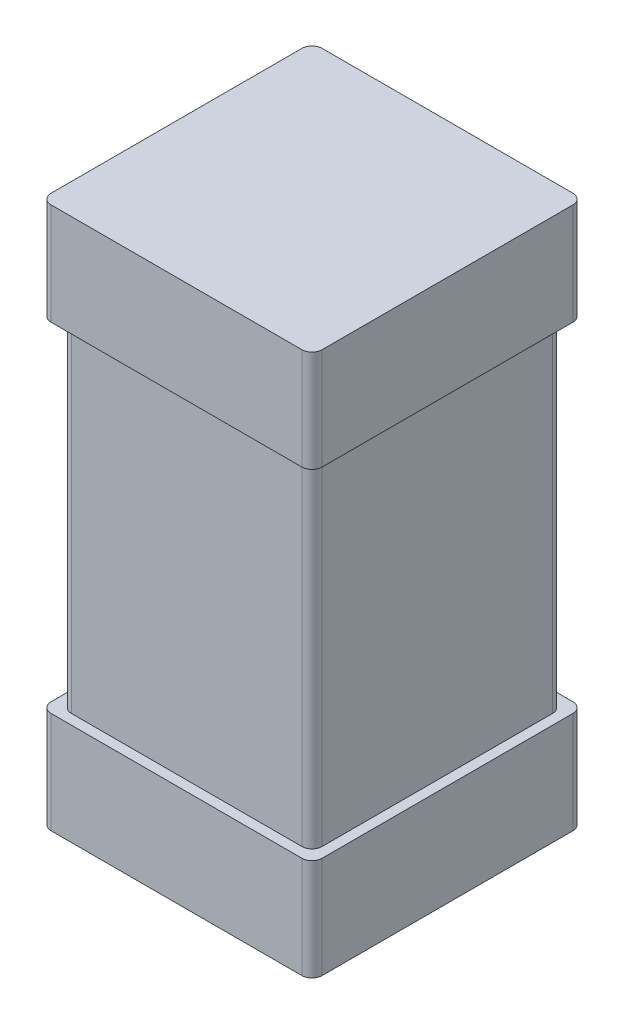
ISO-10303-21;
HEADER;
FILE_DESCRIPTION(('STEP AP214'),'2;1');
FILE_NAME('part.step','',(''),(''),'','','');
FILE_SCHEMA(('AUTOMOTIVE_DESIGN { 1 0 10303 214 1 1 1 1 }'));
ENDSEC;
DATA;
#1=APPLICATION_CONTEXT('core data for automotive mechanical design processes');
#2=APPLICATION_PROTOCOL_DEFINITION('international standard','automotive_design',2000,#1);
#3=PRODUCT_CONTEXT('',#1,'mechanical');
#4=PRODUCT('Part','Part','',(#3));
#5=PRODUCT_RELATED_PRODUCT_CATEGORY('part','',(#4));
#6=PRODUCT_DEFINITION_FORMATION('','',#4);
#7=PRODUCT_DEFINITION_CONTEXT('part definition',#1,'design');
#8=PRODUCT_DEFINITION('design','',#6,#7);
#9=PRODUCT_DEFINITION_SHAPE('','',#8);
#10=(LENGTH_UNIT() NAMED_UNIT(*) SI_UNIT(.MILLI.,.METRE.));
#11=(NAMED_UNIT(*) PLANE_ANGLE_UNIT() SI_UNIT($,.RADIAN.));
#12=(NAMED_UNIT(*) SI_UNIT($,.STERADIAN.) SOLID_ANGLE_UNIT());
#13=UNCERTAINTY_MEASURE_WITH_UNIT(LENGTH_MEASURE(1.E-05),#10,'distance_accuracy_value','');
#14=(GEOMETRIC_REPRESENTATION_CONTEXT(3) GLOBAL_UNCERTAINTY_ASSIGNED_CONTEXT((#13)) GLOBAL_UNIT_ASSIGNED_CONTEXT((#10,
#11,#12)) REPRESENTATION_CONTEXT('',''));
#15=CARTESIAN_POINT('',(0.,0.,0.));
#16=DIRECTION('',(0.,0.,1.));
#17=DIRECTION('',(1.,0.,0.));
#18=AXIS2_PLACEMENT_3D('',#15,#16,#17);
#19=CARTESIAN_POINT('',(150.492744279938,114.37054329235,112.211582908599));
#20=DIRECTION('',(0.,1.,0.));
#21=DIRECTION('',(1.,0.,0.));
#22=AXIS2_PLACEMENT_3D('',#19,#20,#21);
#23=PLANE('',#22);
#24=DIRECTION('',(0.,0.,1.));
#25=VECTOR('',#24,1.);
#26=CARTESIAN_POINT('',(150.492744279938,114.37054329235,112.211582908599));
#27=LINE('',#26,#25);
#28=CARTESIAN_POINT('',(150.492744279938,114.37054329235,112.241582908599));
#29=VERTEX_POINT('',#28);
#30=CARTESIAN_POINT('',(150.492744279938,114.37054329235,112.981582908599));
#31=VERTEX_POINT('',#30);
#32=EDGE_CURVE('E67',#29,#31,#27,.T.);
#33=ORIENTED_EDGE('',*,*,#32,.F.);
#34=CARTESIAN_POINT('',(150.462744279938,114.37054329235,112.241582908599));
#35=DIRECTION('',(0.,1.,0.));
#36=DIRECTION('',(0.,0.,1.));
#37=AXIS2_PLACEMENT_3D('',#34,#35,#36);
#38=CIRCLE('',#37,0.0300000000000023);
#39=CARTESIAN_POINT('',(150.462744279938,114.37054329235,112.211582908599));
#40=VERTEX_POINT('',#39);
#41=EDGE_CURVE('E11',#29,#40,#38,.T.);
#42=ORIENTED_EDGE('',*,*,#41,.T.);
#43=DIRECTION('',(-1.,0.,0.));
#44=VECTOR('',#43,1.);
#45=CARTESIAN_POINT('',(150.492744279938,114.37054329235,112.211582908599));
#46=LINE('',#45,#44);
#47=CARTESIAN_POINT('',(149.722744279938,114.37054329235,112.211582908599));
#48=VERTEX_POINT('',#47);
#49=EDGE_CURVE('E55',#40,#48,#46,.T.);
#50=ORIENTED_EDGE('',*,*,#49,.T.);
#51=CARTESIAN_POINT('',(149.722744279938,114.37054329235,112.241582908599));
#52=DIRECTION('',(0.,-1.,0.));
#53=DIRECTION('',(0.,0.,1.));
#54=AXIS2_PLACEMENT_3D('',#51,#52,#53);
#55=CIRCLE('',#54,0.0300000000000023);
#56=CARTESIAN_POINT('',(149.692744279938,114.37054329235,112.241582908599));
#57=VERTEX_POINT('',#56);
#58=EDGE_CURVE('E442',#57,#48,#55,.T.);
#59=ORIENTED_EDGE('',*,*,#58,.F.);
#60=DIRECTION('',(0.,0.,1.));
#61=VECTOR('',#60,1.);
#62=CARTESIAN_POINT('',(149.692744279938,114.37054329235,112.211582908599));
#63=LINE('',#62,#61);
#64=CARTESIAN_POINT('',(149.692744279938,114.37054329235,112.981582908599));
#65=VERTEX_POINT('',#64);
#66=EDGE_CURVE('E313',#57,#65,#63,.T.);
#67=ORIENTED_EDGE('',*,*,#66,.T.);
#68=CARTESIAN_POINT('',(149.722744279938,114.37054329235,112.981582908599));
#69=DIRECTION('',(0.,1.,0.));
#70=DIRECTION('',(0.,0.,1.));
#71=AXIS2_PLACEMENT_3D('',#68,#69,#70);
#72=CIRCLE('',#71,0.0300000000000023);
#73=CARTESIAN_POINT('',(149.722744279938,114.37054329235,113.011582908599));
#74=VERTEX_POINT('',#73);
#75=EDGE_CURVE('E309',#65,#74,#72,.T.);
#76=ORIENTED_EDGE('',*,*,#75,.T.);
#77=DIRECTION('',(-1.,0.,0.));
#78=VECTOR('',#77,1.);
#79=CARTESIAN_POINT('',(150.492744279938,114.37054329235,113.011582908599));
#80=LINE('',#79,#78);
#81=CARTESIAN_POINT('',(150.462744279938,114.37054329235,113.011582908599));
#82=VERTEX_POINT('',#81);
#83=EDGE_CURVE('E424',#82,#74,#80,.T.);
#84=ORIENTED_EDGE('',*,*,#83,.F.);
#85=CARTESIAN_POINT('',(150.462744279938,114.37054329235,112.981582908599));
#86=DIRECTION('',(0.,-1.,0.));
#87=DIRECTION('',(0.,0.,1.));
#88=AXIS2_PLACEMENT_3D('',#85,#86,#87);
#89=CIRCLE('',#88,0.0300000000000023);
#90=EDGE_CURVE('E323',#31,#82,#89,.T.);
#91=ORIENTED_EDGE('',*,*,#90,.F.);
#92=EDGE_LOOP('',(#33,#42,#50,#59,#67,#76,#84,#91));
#93=FACE_BOUND('',#92,.T.);
#94=ADVANCED_FACE('F44',(#93),#23,.T.);
#95=CARTESIAN_POINT('',(149.692744279938,114.07054329235,112.211582908599));
#96=DIRECTION('',(-1.,0.,0.));
#97=DIRECTION('',(0.,0.,1.));
#98=AXIS2_PLACEMENT_3D('',#95,#96,#97);
#99=PLANE('',#98);
#100=ORIENTED_EDGE('',*,*,#66,.F.);
#101=DIRECTION('',(0.,1.,0.));
#102=VECTOR('',#101,1.);
#103=CARTESIAN_POINT('',(149.692744279938,114.07054329235,112.241582908599));
#104=LINE('',#103,#102);
#105=CARTESIAN_POINT('',(149.692744279938,114.07054329235,112.241582908599));
#106=VERTEX_POINT('',#105);
#107=EDGE_CURVE('E225',#106,#57,#104,.T.);
#108=ORIENTED_EDGE('',*,*,#107,.F.);
#109=DIRECTION('',(0.,0.,1.));
#110=VECTOR('',#109,1.);
#111=CARTESIAN_POINT('',(149.692744279938,114.07054329235,112.211582908599));
#112=LINE('',#111,#110);
#113=CARTESIAN_POINT('',(149.692744279938,114.07054329235,112.981582908599));
#114=VERTEX_POINT('',#113);
#115=EDGE_CURVE('E307',#106,#114,#112,.T.);
#116=ORIENTED_EDGE('',*,*,#115,.T.);
#117=DIRECTION('',(0.,1.,0.));
#118=VECTOR('',#117,1.);
#119=CARTESIAN_POINT('',(149.692744279938,114.07054329235,112.981582908599));
#120=LINE('',#119,#118);
#121=EDGE_CURVE('E304',#114,#65,#120,.T.);
#122=ORIENTED_EDGE('',*,*,#121,.T.);
#123=EDGE_LOOP('',(#100,#108,#116,#122));
#124=FACE_BOUND('',#123,.T.);
#125=ADVANCED_FACE('F599',(#124),#99,.T.);
#126=CARTESIAN_POINT('',(149.722744279938,114.07054329235,112.981582908599));
#127=DIRECTION('',(0.,1.,0.));
#128=DIRECTION('',(-1.,0.,0.));
#129=AXIS2_PLACEMENT_3D('',#126,#127,#128);
#130=CYLINDRICAL_SURFACE('',#129,0.0300000000000023);
#131=CARTESIAN_POINT('',(149.722744279938,114.07054329235,112.981582908599));
#132=DIRECTION('',(0.,1.,0.));
#133=DIRECTION('',(0.,0.,1.));
#134=AXIS2_PLACEMENT_3D('',#131,#132,#133);
#135=CIRCLE('',#134,0.0300000000000023);
#136=CARTESIAN_POINT('',(149.722744279938,114.07054329235,113.011582908599));
#137=VERTEX_POINT('',#136);
#138=EDGE_CURVE('E308',#114,#137,#135,.T.);
#139=ORIENTED_EDGE('',*,*,#138,.T.);
#140=DIRECTION('',(0.,1.,0.));
#141=VECTOR('',#140,1.);
#142=CARTESIAN_POINT('',(149.722744279938,114.07054329235,113.011582908599));
#143=LINE('',#142,#141);
#144=EDGE_CURVE('E488',#137,#74,#143,.T.);
#145=ORIENTED_EDGE('',*,*,#144,.T.);
#146=ORIENTED_EDGE('',*,*,#75,.F.);
#147=ORIENTED_EDGE('',*,*,#121,.F.);
#148=EDGE_LOOP('',(#139,#145,#146,#147));
#149=FACE_BOUND('',#148,.T.);
#150=ADVANCED_FACE('F604',(#149),#130,.T.);
#151=CARTESIAN_POINT('',(149.722744279938,114.07054329235,112.241582908599));
#152=DIRECTION('',(0.,1.,0.));
#153=DIRECTION('',(-1.,0.,0.));
#154=AXIS2_PLACEMENT_3D('',#151,#152,#153);
#155=CYLINDRICAL_SURFACE('',#154,0.0300000000000023);
#156=ORIENTED_EDGE('',*,*,#107,.T.);
#157=ORIENTED_EDGE('',*,*,#58,.T.);
#158=DIRECTION('',(0.,1.,0.));
#159=VECTOR('',#158,1.);
#160=CARTESIAN_POINT('',(149.722744279938,114.07054329235,112.211582908599));
#161=LINE('',#160,#159);
#162=CARTESIAN_POINT('',(149.722744279938,114.07054329235,112.211582908599));
#163=VERTEX_POINT('',#162);
#164=EDGE_CURVE('E428',#163,#48,#161,.T.);
#165=ORIENTED_EDGE('',*,*,#164,.F.);
#166=CARTESIAN_POINT('',(149.722744279938,114.07054329235,112.241582908599));
#167=DIRECTION('',(0.,-1.,0.));
#168=DIRECTION('',(0.,0.,1.));
#169=AXIS2_PLACEMENT_3D('',#166,#167,#168);
#170=CIRCLE('',#169,0.0300000000000023);
#171=EDGE_CURVE('E355',#106,#163,#170,.T.);
#172=ORIENTED_EDGE('',*,*,#171,.F.);
#173=EDGE_LOOP('',(#156,#157,#165,#172));
#174=FACE_BOUND('',#173,.T.);
#175=ADVANCED_FACE('F671',(#174),#155,.T.);
#176=CARTESIAN_POINT('',(150.492744279938,114.07054329235,113.011582908599));
#177=DIRECTION('',(0.,0.,1.));
#178=DIRECTION('',(1.,0.,0.));
#179=AXIS2_PLACEMENT_3D('',#176,#177,#178);
#180=PLANE('',#179);
#181=DIRECTION('',(-1.,0.,0.));
#182=VECTOR('',#181,1.);
#183=CARTESIAN_POINT('',(150.492744279938,114.07054329235,113.011582908599));
#184=LINE('',#183,#182);
#185=CARTESIAN_POINT('',(150.462744279938,114.07054329235,113.011582908599));
#186=VERTEX_POINT('',#185);
#187=EDGE_CURVE('E358',#186,#137,#184,.T.);
#188=ORIENTED_EDGE('',*,*,#187,.F.);
#189=DIRECTION('',(0.,1.,0.));
#190=VECTOR('',#189,1.);
#191=CARTESIAN_POINT('',(150.462744279938,114.07054329235,113.011582908599));
#192=LINE('',#191,#190);
#193=EDGE_CURVE('E427',#186,#82,#192,.T.);
#194=ORIENTED_EDGE('',*,*,#193,.T.);
#195=ORIENTED_EDGE('',*,*,#83,.T.);
#196=ORIENTED_EDGE('',*,*,#144,.F.);
#197=EDGE_LOOP('',(#188,#194,#195,#196));
#198=FACE_BOUND('',#197,.T.);
#199=ADVANCED_FACE('F621',(#198),#180,.T.);
#200=CARTESIAN_POINT('',(150.492744279938,114.07054329235,112.211582908599));
#201=DIRECTION('',(0.,0.,1.));
#202=DIRECTION('',(1.,0.,0.));
#203=AXIS2_PLACEMENT_3D('',#200,#201,#202);
#204=PLANE('',#203);
#205=ORIENTED_EDGE('',*,*,#164,.T.);
#206=ORIENTED_EDGE('',*,*,#49,.F.);
#207=DIRECTION('',(0.,1.,0.));
#208=VECTOR('',#207,1.);
#209=CARTESIAN_POINT('',(150.462744279938,114.07054329235,112.211582908599));
#210=LINE('',#209,#208);
#211=CARTESIAN_POINT('',(150.462744279938,114.07054329235,112.211582908599));
#212=VERTEX_POINT('',#211);
#213=EDGE_CURVE('E365',#212,#40,#210,.T.);
#214=ORIENTED_EDGE('',*,*,#213,.F.);
#215=DIRECTION('',(-1.,0.,0.));
#216=VECTOR('',#215,1.);
#217=CARTESIAN_POINT('',(150.492744279938,114.07054329235,112.211582908599));
#218=LINE('',#217,#216);
#219=EDGE_CURVE('E432',#212,#163,#218,.T.);
#220=ORIENTED_EDGE('',*,*,#219,.T.);
#221=EDGE_LOOP('',(#205,#206,#214,#220));
#222=FACE_BOUND('',#221,.T.);
#223=ADVANCED_FACE('F617',(#222),#204,.F.);
#224=CARTESIAN_POINT('',(150.462744279938,114.07054329235,112.981582908599));
#225=DIRECTION('',(0.,1.,0.));
#226=DIRECTION('',(1.,0.,0.));
#227=AXIS2_PLACEMENT_3D('',#224,#225,#226);
#228=CYLINDRICAL_SURFACE('',#227,0.0300000000000023);
#229=DIRECTION('',(0.,1.,0.));
#230=VECTOR('',#229,1.);
#231=CARTESIAN_POINT('',(150.492744279938,114.07054329235,112.981582908599));
#232=LINE('',#231,#230);
#233=CARTESIAN_POINT('',(150.492744279938,114.07054329235,112.981582908599));
#234=VERTEX_POINT('',#233);
#235=EDGE_CURVE('E326',#234,#31,#232,.T.);
#236=ORIENTED_EDGE('',*,*,#235,.T.);
#237=ORIENTED_EDGE('',*,*,#90,.T.);
#238=ORIENTED_EDGE('',*,*,#193,.F.);
#239=CARTESIAN_POINT('',(150.462744279938,114.07054329235,112.981582908599));
#240=DIRECTION('',(0.,-1.,0.));
#241=DIRECTION('',(0.,0.,1.));
#242=AXIS2_PLACEMENT_3D('',#239,#240,#241);
#243=CIRCLE('',#242,0.0300000000000023);
#244=EDGE_CURVE('E382',#234,#186,#243,.T.);
#245=ORIENTED_EDGE('',*,*,#244,.F.);
#246=EDGE_LOOP('',(#236,#237,#238,#245));
#247=FACE_BOUND('',#246,.T.);
#248=ADVANCED_FACE('F620',(#247),#228,.T.);
#249=CARTESIAN_POINT('',(150.462744279938,114.07054329235,112.241582908599));
#250=DIRECTION('',(0.,1.,0.));
#251=DIRECTION('',(1.,0.,0.));
#252=AXIS2_PLACEMENT_3D('',#249,#250,#251);
#253=CYLINDRICAL_SURFACE('',#252,0.0300000000000023);
#254=CARTESIAN_POINT('',(150.462744279938,114.07054329235,112.241582908599));
#255=DIRECTION('',(0.,1.,0.));
#256=DIRECTION('',(0.,0.,1.));
#257=AXIS2_PLACEMENT_3D('',#254,#255,#256);
#258=CIRCLE('',#257,0.0300000000000023);
#259=CARTESIAN_POINT('',(150.492744279938,114.07054329235,112.241582908599));
#260=VERTEX_POINT('',#259);
#261=EDGE_CURVE('E327',#260,#212,#258,.T.);
#262=ORIENTED_EDGE('',*,*,#261,.T.);
#263=ORIENTED_EDGE('',*,*,#213,.T.);
#264=ORIENTED_EDGE('',*,*,#41,.F.);
#265=DIRECTION('',(0.,1.,0.));
#266=VECTOR('',#265,1.);
#267=CARTESIAN_POINT('',(150.492744279938,114.07054329235,112.241582908599));
#268=LINE('',#267,#266);
#269=EDGE_CURVE('E368',#260,#29,#268,.T.);
#270=ORIENTED_EDGE('',*,*,#269,.F.);
#271=EDGE_LOOP('',(#262,#263,#264,#270));
#272=FACE_BOUND('',#271,.T.);
#273=ADVANCED_FACE('F595',(#272),#253,.T.);
#274=CARTESIAN_POINT('',(150.492744279938,114.07054329235,112.211582908599));
#275=DIRECTION('',(-1.,0.,0.));
#276=DIRECTION('',(0.,0.,1.));
#277=AXIS2_PLACEMENT_3D('',#274,#275,#276);
#278=PLANE('',#277);
#279=ORIENTED_EDGE('',*,*,#235,.F.);
#280=DIRECTION('',(0.,0.,1.));
#281=VECTOR('',#280,1.);
#282=CARTESIAN_POINT('',(150.492744279938,114.07054329235,112.211582908599));
#283=LINE('',#282,#281);
#284=EDGE_CURVE('E359',#260,#234,#283,.T.);
#285=ORIENTED_EDGE('',*,*,#284,.F.);
#286=ORIENTED_EDGE('',*,*,#269,.T.);
#287=ORIENTED_EDGE('',*,*,#32,.T.);
#288=EDGE_LOOP('',(#279,#285,#286,#287));
#289=FACE_BOUND('',#288,.T.);
#290=ADVANCED_FACE('F587',(#289),#278,.F.);
#291=CARTESIAN_POINT('',(150.492744279938,114.07054329235,112.211582908599));
#292=DIRECTION('',(0.,1.,0.));
#293=DIRECTION('',(1.,0.,0.));
#294=AXIS2_PLACEMENT_3D('',#291,#292,#293);
#295=PLANE('',#294);
#296=ORIENTED_EDGE('',*,*,#244,.T.);
#297=ORIENTED_EDGE('',*,*,#187,.T.);
#298=ORIENTED_EDGE('',*,*,#138,.F.);
#299=ORIENTED_EDGE('',*,*,#115,.F.);
#300=ORIENTED_EDGE('',*,*,#171,.T.);
#301=ORIENTED_EDGE('',*,*,#219,.F.);
#302=ORIENTED_EDGE('',*,*,#261,.F.);
#303=ORIENTED_EDGE('',*,*,#284,.T.);
#304=EDGE_LOOP('',(#296,#297,#298,#299,#300,#301,#302,#303));
#305=FACE_BOUND('',#304,.T.);
#306=DIRECTION('',(-1.,0.,0.));
#307=VECTOR('',#306,1.);
#308=CARTESIAN_POINT('',(150.462744279938,114.07054329235,112.241582908599));
#309=LINE('',#308,#307);
#310=CARTESIAN_POINT('',(150.432744279938,114.07054329235,112.241582908599));
#311=VERTEX_POINT('',#310);
#312=CARTESIAN_POINT('',(149.752744279938,114.07054329235,112.241582908599));
#313=VERTEX_POINT('',#312);
#314=EDGE_CURVE('E390',#311,#313,#309,.T.);
#315=ORIENTED_EDGE('',*,*,#314,.T.);
#316=CARTESIAN_POINT('',(149.752744279938,114.07054329235,112.271582908599));
#317=DIRECTION('',(0.,-1.,0.));
#318=DIRECTION('',(0.,0.,1.));
#319=AXIS2_PLACEMENT_3D('',#316,#317,#318);
#320=CIRCLE('',#319,0.0300000000000023);
#321=CARTESIAN_POINT('',(149.722744279938,114.07054329235,112.271582908599));
#322=VERTEX_POINT('',#321);
#323=EDGE_CURVE('E529',#322,#313,#320,.T.);
#324=ORIENTED_EDGE('',*,*,#323,.F.);
#325=DIRECTION('',(0.,0.,1.));
#326=VECTOR('',#325,1.);
#327=CARTESIAN_POINT('',(149.722744279938,114.07054329235,112.241582908599));
#328=LINE('',#327,#326);
#329=CARTESIAN_POINT('',(149.722744279938,114.07054329235,112.951582908599));
#330=VERTEX_POINT('',#329);
#331=EDGE_CURVE('E353',#322,#330,#328,.T.);
#332=ORIENTED_EDGE('',*,*,#331,.T.);
#333=CARTESIAN_POINT('',(149.752744279938,114.07054329235,112.951582908599));
#334=DIRECTION('',(0.,1.,0.));
#335=DIRECTION('',(0.,0.,1.));
#336=AXIS2_PLACEMENT_3D('',#333,#334,#335);
#337=CIRCLE('',#336,0.0300000000000023);
#338=CARTESIAN_POINT('',(149.752744279938,114.07054329235,112.981582908599));
#339=VERTEX_POINT('',#338);
#340=EDGE_CURVE('E349',#330,#339,#337,.T.);
#341=ORIENTED_EDGE('',*,*,#340,.T.);
#342=DIRECTION('',(-1.,0.,0.));
#343=VECTOR('',#342,1.);
#344=CARTESIAN_POINT('',(150.462744279938,114.07054329235,112.981582908599));
#345=LINE('',#344,#343);
#346=CARTESIAN_POINT('',(150.432744279938,114.07054329235,112.981582908599));
#347=VERTEX_POINT('',#346);
#348=EDGE_CURVE('E285',#347,#339,#345,.T.);
#349=ORIENTED_EDGE('',*,*,#348,.F.);
#350=CARTESIAN_POINT('',(150.432744279938,114.07054329235,112.951582908599));
#351=DIRECTION('',(0.,-1.,0.));
#352=DIRECTION('',(0.,0.,1.));
#353=AXIS2_PLACEMENT_3D('',#350,#351,#352);
#354=CIRCLE('',#353,0.0300000000000023);
#355=CARTESIAN_POINT('',(150.462744279938,114.07054329235,112.951582908599));
#356=VERTEX_POINT('',#355);
#357=EDGE_CURVE('E282',#356,#347,#354,.T.);
#358=ORIENTED_EDGE('',*,*,#357,.F.);
#359=DIRECTION('',(0.,0.,1.));
#360=VECTOR('',#359,1.);
#361=CARTESIAN_POINT('',(150.462744279938,114.07054329235,112.241582908599));
#362=LINE('',#361,#360);
#363=CARTESIAN_POINT('',(150.462744279938,114.07054329235,112.271582908599));
#364=VERTEX_POINT('',#363);
#365=EDGE_CURVE('E340',#364,#356,#362,.T.);
#366=ORIENTED_EDGE('',*,*,#365,.F.);
#367=CARTESIAN_POINT('',(150.432744279938,114.07054329235,112.271582908599));
#368=DIRECTION('',(0.,1.,0.));
#369=DIRECTION('',(0.,0.,1.));
#370=AXIS2_PLACEMENT_3D('',#367,#368,#369);
#371=CIRCLE('',#370,0.0300000000000023);
#372=EDGE_CURVE('E354',#364,#311,#371,.T.);
#373=ORIENTED_EDGE('',*,*,#372,.T.);
#374=EDGE_LOOP('',(#315,#324,#332,#341,#349,#358,#366,#373));
#375=FACE_BOUND('',#374,.T.);
#376=ADVANCED_FACE('F585',(#305,#375),#295,.F.);
#377=CARTESIAN_POINT('',(150.462744279938,113.07054329235,112.241582908599));
#378=DIRECTION('',(-1.,0.,0.));
#379=DIRECTION('',(0.,0.,1.));
#380=AXIS2_PLACEMENT_3D('',#377,#378,#379);
#381=PLANE('',#380);
#382=DIRECTION('',(0.,1.,0.));
#383=VECTOR('',#382,1.);
#384=CARTESIAN_POINT('',(150.462744279938,113.07054329235,112.951582908599));
#385=LINE('',#384,#383);
#386=CARTESIAN_POINT('',(150.462744279938,113.07054329235,112.951582908599));
#387=VERTEX_POINT('',#386);
#388=EDGE_CURVE('E337',#387,#356,#385,.T.);
#389=ORIENTED_EDGE('',*,*,#388,.F.);
#390=DIRECTION('',(0.,0.,1.));
#391=VECTOR('',#390,1.);
#392=CARTESIAN_POINT('',(150.462744279938,113.07054329235,112.241582908599));
#393=LINE('',#392,#391);
#394=CARTESIAN_POINT('',(150.462744279938,113.07054329235,112.271582908599));
#395=VERTEX_POINT('',#394);
#396=EDGE_CURVE('E272',#395,#387,#393,.T.);
#397=ORIENTED_EDGE('',*,*,#396,.F.);
#398=DIRECTION('',(0.,1.,0.));
#399=VECTOR('',#398,1.);
#400=CARTESIAN_POINT('',(150.462744279938,113.07054329235,112.271582908599));
#401=LINE('',#400,#399);
#402=EDGE_CURVE('E386',#395,#364,#401,.T.);
#403=ORIENTED_EDGE('',*,*,#402,.T.);
#404=ORIENTED_EDGE('',*,*,#365,.T.);
#405=EDGE_LOOP('',(#389,#397,#403,#404));
#406=FACE_BOUND('',#405,.T.);
#407=ADVANCED_FACE('F583',(#406),#381,.F.);
#408=CARTESIAN_POINT('',(150.432744279938,113.07054329235,112.951582908599));
#409=DIRECTION('',(0.,1.,0.));
#410=DIRECTION('',(1.,0.,0.));
#411=AXIS2_PLACEMENT_3D('',#408,#409,#410);
#412=CYLINDRICAL_SURFACE('',#411,0.0300000000000023);
#413=ORIENTED_EDGE('',*,*,#388,.T.);
#414=ORIENTED_EDGE('',*,*,#357,.T.);
#415=DIRECTION('',(0.,1.,0.));
#416=VECTOR('',#415,1.);
#417=CARTESIAN_POINT('',(150.432744279938,113.07054329235,112.981582908599));
#418=LINE('',#417,#416);
#419=CARTESIAN_POINT('',(150.432744279938,113.07054329235,112.981582908599));
#420=VERTEX_POINT('',#419);
#421=EDGE_CURVE('E280',#420,#347,#418,.T.);
#422=ORIENTED_EDGE('',*,*,#421,.F.);
#423=CARTESIAN_POINT('',(150.432744279938,113.07054329235,112.951582908599));
#424=DIRECTION('',(0.,-1.,0.));
#425=DIRECTION('',(0.,0.,1.));
#426=AXIS2_PLACEMENT_3D('',#423,#424,#425);
#427=CIRCLE('',#426,0.0300000000000023);
#428=EDGE_CURVE('E264',#387,#420,#427,.T.);
#429=ORIENTED_EDGE('',*,*,#428,.F.);
#430=EDGE_LOOP('',(#413,#414,#422,#429));
#431=FACE_BOUND('',#430,.T.);
#432=ADVANCED_FACE('F281',(#431),#412,.T.);
#433=CARTESIAN_POINT('',(150.462744279938,113.07054329235,112.981582908599));
#434=DIRECTION('',(0.,0.,1.));
#435=DIRECTION('',(1.,0.,0.));
#436=AXIS2_PLACEMENT_3D('',#433,#434,#435);
#437=PLANE('',#436);
#438=DIRECTION('',(-1.,0.,0.));
#439=VECTOR('',#438,1.);
#440=CARTESIAN_POINT('',(150.462744279938,113.07054329235,112.981582908599));
#441=LINE('',#440,#439);
#442=CARTESIAN_POINT('',(149.752744279938,113.07054329235,112.981582908599));
#443=VERTEX_POINT('',#442);
#444=EDGE_CURVE('E270',#420,#443,#441,.T.);
#445=ORIENTED_EDGE('',*,*,#444,.F.);
#446=ORIENTED_EDGE('',*,*,#421,.T.);
#447=ORIENTED_EDGE('',*,*,#348,.T.);
#448=DIRECTION('',(0.,1.,0.));
#449=VECTOR('',#448,1.);
#450=CARTESIAN_POINT('',(149.752744279938,113.07054329235,112.981582908599));
#451=LINE('',#450,#449);
#452=EDGE_CURVE('E289',#443,#339,#451,.T.);
#453=ORIENTED_EDGE('',*,*,#452,.F.);
#454=EDGE_LOOP('',(#445,#446,#447,#453));
#455=FACE_BOUND('',#454,.T.);
#456=ADVANCED_FACE('F287',(#455),#437,.T.);
#457=CARTESIAN_POINT('',(149.752744279938,113.07054329235,112.951582908599));
#458=DIRECTION('',(0.,1.,0.));
#459=DIRECTION('',(-1.,0.,0.));
#460=AXIS2_PLACEMENT_3D('',#457,#458,#459);
#461=CYLINDRICAL_SURFACE('',#460,0.0300000000000023);
#462=CARTESIAN_POINT('',(149.752744279938,113.07054329235,112.951582908599));
#463=DIRECTION('',(0.,1.,0.));
#464=DIRECTION('',(0.,0.,1.));
#465=AXIS2_PLACEMENT_3D('',#462,#463,#464);
#466=CIRCLE('',#465,0.0300000000000023);
#467=CARTESIAN_POINT('',(149.722744279938,113.07054329235,112.951582908599));
#468=VERTEX_POINT('',#467);
#469=EDGE_CURVE('E302',#468,#443,#466,.T.);
#470=ORIENTED_EDGE('',*,*,#469,.T.);
#471=ORIENTED_EDGE('',*,*,#452,.T.);
#472=ORIENTED_EDGE('',*,*,#340,.F.);
#473=DIRECTION('',(0.,1.,0.));
#474=VECTOR('',#473,1.);
#475=CARTESIAN_POINT('',(149.722744279938,113.07054329235,112.951582908599));
#476=LINE('',#475,#474);
#477=EDGE_CURVE('E528',#468,#330,#476,.T.);
#478=ORIENTED_EDGE('',*,*,#477,.F.);
#479=EDGE_LOOP('',(#470,#471,#472,#478));
#480=FACE_BOUND('',#479,.T.);
#481=ADVANCED_FACE('F566',(#480),#461,.T.);
#482=CARTESIAN_POINT('',(149.722744279938,113.07054329235,112.241582908599));
#483=DIRECTION('',(-1.,0.,0.));
#484=DIRECTION('',(0.,0.,1.));
#485=AXIS2_PLACEMENT_3D('',#482,#483,#484);
#486=PLANE('',#485);
#487=ORIENTED_EDGE('',*,*,#331,.F.);
#488=DIRECTION('',(0.,1.,0.));
#489=VECTOR('',#488,1.);
#490=CARTESIAN_POINT('',(149.722744279938,113.07054329235,112.271582908599));
#491=LINE('',#490,#489);
#492=CARTESIAN_POINT('',(149.722744279938,113.07054329235,112.271582908599));
#493=VERTEX_POINT('',#492);
#494=EDGE_CURVE('E524',#493,#322,#491,.T.);
#495=ORIENTED_EDGE('',*,*,#494,.F.);
#496=DIRECTION('',(0.,0.,1.));
#497=VECTOR('',#496,1.);
#498=CARTESIAN_POINT('',(149.722744279938,113.07054329235,112.241582908599));
#499=LINE('',#498,#497);
#500=EDGE_CURVE('E431',#493,#468,#499,.T.);
#501=ORIENTED_EDGE('',*,*,#500,.T.);
#502=ORIENTED_EDGE('',*,*,#477,.T.);
#503=EDGE_LOOP('',(#487,#495,#501,#502));
#504=FACE_BOUND('',#503,.T.);
#505=ADVANCED_FACE('F563',(#504),#486,.T.);
#506=CARTESIAN_POINT('',(149.752744279938,113.07054329235,112.271582908599));
#507=DIRECTION('',(0.,1.,0.));
#508=DIRECTION('',(-1.,0.,0.));
#509=AXIS2_PLACEMENT_3D('',#506,#507,#508);
#510=CYLINDRICAL_SURFACE('',#509,0.0300000000000023);
#511=ORIENTED_EDGE('',*,*,#494,.T.);
#512=ORIENTED_EDGE('',*,*,#323,.T.);
#513=DIRECTION('',(0.,1.,0.));
#514=VECTOR('',#513,1.);
#515=CARTESIAN_POINT('',(149.752744279938,113.07054329235,112.241582908599));
#516=LINE('',#515,#514);
#517=CARTESIAN_POINT('',(149.752744279938,113.07054329235,112.241582908599));
#518=VERTEX_POINT('',#517);
#519=EDGE_CURVE('E500',#518,#313,#516,.T.);
#520=ORIENTED_EDGE('',*,*,#519,.F.);
#521=CARTESIAN_POINT('',(149.752744279938,113.07054329235,112.271582908599));
#522=DIRECTION('',(0.,-1.,0.));
#523=DIRECTION('',(0.,0.,1.));
#524=AXIS2_PLACEMENT_3D('',#521,#522,#523);
#525=CIRCLE('',#524,0.0300000000000023);
#526=EDGE_CURVE('E292',#493,#518,#525,.T.);
#527=ORIENTED_EDGE('',*,*,#526,.F.);
#528=EDGE_LOOP('',(#511,#512,#520,#527));
#529=FACE_BOUND('',#528,.T.);
#530=ADVANCED_FACE('F572',(#529),#510,.T.);
#531=CARTESIAN_POINT('',(150.462744279938,113.07054329235,112.241582908599));
#532=DIRECTION('',(0.,0.,1.));
#533=DIRECTION('',(1.,0.,0.));
#534=AXIS2_PLACEMENT_3D('',#531,#532,#533);
#535=PLANE('',#534);
#536=ORIENTED_EDGE('',*,*,#519,.T.);
#537=ORIENTED_EDGE('',*,*,#314,.F.);
#538=DIRECTION('',(0.,1.,0.));
#539=VECTOR('',#538,1.);
#540=CARTESIAN_POINT('',(150.432744279938,113.07054329235,112.241582908599));
#541=LINE('',#540,#539);
#542=CARTESIAN_POINT('',(150.432744279938,113.07054329235,112.241582908599));
#543=VERTEX_POINT('',#542);
#544=EDGE_CURVE('E364',#543,#311,#541,.T.);
#545=ORIENTED_EDGE('',*,*,#544,.F.);
#546=DIRECTION('',(-1.,0.,0.));
#547=VECTOR('',#546,1.);
#548=CARTESIAN_POINT('',(150.462744279938,113.07054329235,112.241582908599));
#549=LINE('',#548,#547);
#550=EDGE_CURVE('E363',#543,#518,#549,.T.);
#551=ORIENTED_EDGE('',*,*,#550,.T.);
#552=EDGE_LOOP('',(#536,#537,#545,#551));
#553=FACE_BOUND('',#552,.T.);
#554=ADVANCED_FACE('F46',(#553),#535,.F.);
#555=CARTESIAN_POINT('',(150.432744279938,113.07054329235,112.271582908599));
#556=DIRECTION('',(0.,1.,0.));
#557=DIRECTION('',(1.,0.,0.));
#558=AXIS2_PLACEMENT_3D('',#555,#556,#557);
#559=CYLINDRICAL_SURFACE('',#558,0.0300000000000023);
#560=CARTESIAN_POINT('',(150.432744279938,113.07054329235,112.271582908599));
#561=DIRECTION('',(0.,1.,0.));
#562=DIRECTION('',(0.,0.,1.));
#563=AXIS2_PLACEMENT_3D('',#560,#561,#562);
#564=CIRCLE('',#563,0.0300000000000023);
#565=EDGE_CURVE('E360',#395,#543,#564,.T.);
#566=ORIENTED_EDGE('',*,*,#565,.T.);
#567=ORIENTED_EDGE('',*,*,#544,.T.);
#568=ORIENTED_EDGE('',*,*,#372,.F.);
#569=ORIENTED_EDGE('',*,*,#402,.F.);
#570=EDGE_LOOP('',(#566,#567,#568,#569));
#571=FACE_BOUND('',#570,.T.);
#572=ADVANCED_FACE('F578',(#571),#559,.T.);
#573=CARTESIAN_POINT('',(150.492744279938,113.07054329235,112.211582908599));
#574=DIRECTION('',(0.,1.,0.));
#575=DIRECTION('',(1.,0.,0.));
#576=AXIS2_PLACEMENT_3D('',#573,#574,#575);
#577=PLANE('',#576);
#578=DIRECTION('',(0.,0.,1.));
#579=VECTOR('',#578,1.);
#580=CARTESIAN_POINT('',(150.492744279938,113.07054329235,112.211582908599));
#581=LINE('',#580,#579);
#582=CARTESIAN_POINT('',(150.492744279938,113.07054329235,112.241582908599));
#583=VERTEX_POINT('',#582);
#584=CARTESIAN_POINT('',(150.492744279938,113.07054329235,112.981582908599));
#585=VERTEX_POINT('',#584);
#586=EDGE_CURVE('E345',#583,#585,#581,.T.);
#587=ORIENTED_EDGE('',*,*,#586,.F.);
#588=CARTESIAN_POINT('',(150.462744279938,113.07054329235,112.241582908599));
#589=DIRECTION('',(0.,1.,0.));
#590=DIRECTION('',(0.,0.,1.));
#591=AXIS2_PLACEMENT_3D('',#588,#589,#590);
#592=CIRCLE('',#591,0.0300000000000023);
#593=CARTESIAN_POINT('',(150.462744279938,113.07054329235,112.211582908599));
#594=VERTEX_POINT('',#593);
#595=EDGE_CURVE('E447',#583,#594,#592,.T.);
#596=ORIENTED_EDGE('',*,*,#595,.T.);
#597=DIRECTION('',(-1.,0.,0.));
#598=VECTOR('',#597,1.);
#599=CARTESIAN_POINT('',(150.492744279938,113.07054329235,112.211582908599));
#600=LINE('',#599,#598);
#601=CARTESIAN_POINT('',(149.722744279938,113.07054329235,112.211582908599));
#602=VERTEX_POINT('',#601);
#603=EDGE_CURVE('E443',#594,#602,#600,.T.);
#604=ORIENTED_EDGE('',*,*,#603,.T.);
#605=CARTESIAN_POINT('',(149.722744279938,113.07054329235,112.241582908599));
#606=DIRECTION('',(0.,-1.,0.));
#607=DIRECTION('',(0.,0.,1.));
#608=AXIS2_PLACEMENT_3D('',#605,#606,#607);
#609=CIRCLE('',#608,0.0300000000000023);
#610=CARTESIAN_POINT('',(149.692744279938,113.07054329235,112.241582908599));
#611=VERTEX_POINT('',#610);
#612=EDGE_CURVE('E403',#611,#602,#609,.T.);
#613=ORIENTED_EDGE('',*,*,#612,.F.);
#614=DIRECTION('',(0.,0.,1.));
#615=VECTOR('',#614,1.);
#616=CARTESIAN_POINT('',(149.692744279938,113.07054329235,112.211582908599));
#617=LINE('',#616,#615);
#618=CARTESIAN_POINT('',(149.692744279938,113.07054329235,112.981582908599));
#619=VERTEX_POINT('',#618);
#620=EDGE_CURVE('E448',#611,#619,#617,.T.);
#621=ORIENTED_EDGE('',*,*,#620,.T.);
#622=CARTESIAN_POINT('',(149.722744279938,113.07054329235,112.981582908599));
#623=DIRECTION('',(0.,1.,0.));
#624=DIRECTION('',(0.,0.,1.));
#625=AXIS2_PLACEMENT_3D('',#622,#623,#624);
#626=CIRCLE('',#625,0.0300000000000023);
#627=CARTESIAN_POINT('',(149.722744279938,113.07054329235,113.011582908599));
#628=VERTEX_POINT('',#627);
#629=EDGE_CURVE('E512',#619,#628,#626,.T.);
#630=ORIENTED_EDGE('',*,*,#629,.T.);
#631=DIRECTION('',(-1.,0.,0.));
#632=VECTOR('',#631,1.);
#633=CARTESIAN_POINT('',(150.492744279938,113.07054329235,113.011582908599));
#634=LINE('',#633,#632);
#635=CARTESIAN_POINT('',(150.462744279938,113.07054329235,113.011582908599));
#636=VERTEX_POINT('',#635);
#637=EDGE_CURVE('E395',#636,#628,#634,.T.);
#638=ORIENTED_EDGE('',*,*,#637,.F.);
#639=CARTESIAN_POINT('',(150.462744279938,113.07054329235,112.981582908599));
#640=DIRECTION('',(0.,-1.,0.));
#641=DIRECTION('',(0.,0.,1.));
#642=AXIS2_PLACEMENT_3D('',#639,#640,#641);
#643=CIRCLE('',#642,0.0300000000000023);
#644=EDGE_CURVE('E421',#585,#636,#643,.T.);
#645=ORIENTED_EDGE('',*,*,#644,.F.);
#646=EDGE_LOOP('',(#587,#596,#604,#613,#621,#630,#638,#645));
#647=FACE_BOUND('',#646,.T.);
#648=ORIENTED_EDGE('',*,*,#565,.F.);
#649=ORIENTED_EDGE('',*,*,#396,.T.);
#650=ORIENTED_EDGE('',*,*,#428,.T.);
#651=ORIENTED_EDGE('',*,*,#444,.T.);
#652=ORIENTED_EDGE('',*,*,#469,.F.);
#653=ORIENTED_EDGE('',*,*,#500,.F.);
#654=ORIENTED_EDGE('',*,*,#526,.T.);
#655=ORIENTED_EDGE('',*,*,#550,.F.);
#656=EDGE_LOOP('',(#648,#649,#650,#651,#652,#653,#654,#655));
#657=FACE_BOUND('',#656,.T.);
#658=ADVANCED_FACE('F267',(#647,#657),#577,.T.);
#659=CARTESIAN_POINT('',(149.692744279938,112.77054329235,112.211582908599));
#660=DIRECTION('',(-1.,0.,0.));
#661=DIRECTION('',(0.,0.,1.));
#662=AXIS2_PLACEMENT_3D('',#659,#660,#661);
#663=PLANE('',#662);
#664=ORIENTED_EDGE('',*,*,#620,.F.);
#665=DIRECTION('',(0.,1.,0.));
#666=VECTOR('',#665,1.);
#667=CARTESIAN_POINT('',(149.692744279938,112.77054329235,112.241582908599));
#668=LINE('',#667,#666);
#669=CARTESIAN_POINT('',(149.692744279938,112.77054329235,112.241582908599));
#670=VERTEX_POINT('',#669);
#671=EDGE_CURVE('E336',#670,#611,#668,.T.);
#672=ORIENTED_EDGE('',*,*,#671,.F.);
#673=DIRECTION('',(0.,0.,1.));
#674=VECTOR('',#673,1.);
#675=CARTESIAN_POINT('',(149.692744279938,112.77054329235,112.211582908599));
#676=LINE('',#675,#674);
#677=CARTESIAN_POINT('',(149.692744279938,112.77054329235,112.981582908599));
#678=VERTEX_POINT('',#677);
#679=EDGE_CURVE('E298',#670,#678,#676,.T.);
#680=ORIENTED_EDGE('',*,*,#679,.T.);
#681=DIRECTION('',(0.,1.,0.));
#682=VECTOR('',#681,1.);
#683=CARTESIAN_POINT('',(149.692744279938,112.77054329235,112.981582908599));
#684=LINE('',#683,#682);
#685=EDGE_CURVE('E482',#678,#619,#684,.T.);
#686=ORIENTED_EDGE('',*,*,#685,.T.);
#687=EDGE_LOOP('',(#664,#672,#680,#686));
#688=FACE_BOUND('',#687,.T.);
#689=ADVANCED_FACE('F630',(#688),#663,.T.);
#690=CARTESIAN_POINT('',(149.722744279938,112.77054329235,112.981582908599));
#691=DIRECTION('',(0.,1.,0.));
#692=DIRECTION('',(-1.,0.,0.));
#693=AXIS2_PLACEMENT_3D('',#690,#691,#692);
#694=CYLINDRICAL_SURFACE('',#693,0.0300000000000023);
#695=CARTESIAN_POINT('',(149.722744279938,112.77054329235,112.981582908599));
#696=DIRECTION('',(0.,1.,0.));
#697=DIRECTION('',(0.,0.,1.));
#698=AXIS2_PLACEMENT_3D('',#695,#696,#697);
#699=CIRCLE('',#698,0.0300000000000023);
#700=CARTESIAN_POINT('',(149.722744279938,112.77054329235,113.011582908599));
#701=VERTEX_POINT('',#700);
#702=EDGE_CURVE('E335',#678,#701,#699,.T.);
#703=ORIENTED_EDGE('',*,*,#702,.T.);
#704=DIRECTION('',(0.,1.,0.));
#705=VECTOR('',#704,1.);
#706=CARTESIAN_POINT('',(149.722744279938,112.77054329235,113.011582908599));
#707=LINE('',#706,#705);
#708=EDGE_CURVE('E331',#701,#628,#707,.T.);
#709=ORIENTED_EDGE('',*,*,#708,.T.);
#710=ORIENTED_EDGE('',*,*,#629,.F.);
#711=ORIENTED_EDGE('',*,*,#685,.F.);
#712=EDGE_LOOP('',(#703,#709,#710,#711));
#713=FACE_BOUND('',#712,.T.);
#714=ADVANCED_FACE('F632',(#713),#694,.T.);
#715=CARTESIAN_POINT('',(149.722744279938,112.77054329235,112.241582908599));
#716=DIRECTION('',(0.,1.,0.));
#717=DIRECTION('',(-1.,0.,0.));
#718=AXIS2_PLACEMENT_3D('',#715,#716,#717);
#719=CYLINDRICAL_SURFACE('',#718,0.0300000000000023);
#720=ORIENTED_EDGE('',*,*,#671,.T.);
#721=ORIENTED_EDGE('',*,*,#612,.T.);
#722=DIRECTION('',(0.,1.,0.));
#723=VECTOR('',#722,1.);
#724=CARTESIAN_POINT('',(149.722744279938,112.77054329235,112.211582908599));
#725=LINE('',#724,#723);
#726=CARTESIAN_POINT('',(149.722744279938,112.77054329235,112.211582908599));
#727=VERTEX_POINT('',#726);
#728=EDGE_CURVE('E391',#727,#602,#725,.T.);
#729=ORIENTED_EDGE('',*,*,#728,.F.);
#730=CARTESIAN_POINT('',(149.722744279938,112.77054329235,112.241582908599));
#731=DIRECTION('',(0.,-1.,0.));
#732=DIRECTION('',(0.,0.,1.));
#733=AXIS2_PLACEMENT_3D('',#730,#731,#732);
#734=CIRCLE('',#733,0.0300000000000023);
#735=EDGE_CURVE('E322',#670,#727,#734,.T.);
#736=ORIENTED_EDGE('',*,*,#735,.F.);
#737=EDGE_LOOP('',(#720,#721,#729,#736));
#738=FACE_BOUND('',#737,.T.);
#739=ADVANCED_FACE('F629',(#738),#719,.T.);
#740=CARTESIAN_POINT('',(150.492744279938,112.77054329235,113.011582908599));
#741=DIRECTION('',(0.,0.,1.));
#742=DIRECTION('',(1.,0.,0.));
#743=AXIS2_PLACEMENT_3D('',#740,#741,#742);
#744=PLANE('',#743);
#745=DIRECTION('',(-1.,0.,0.));
#746=VECTOR('',#745,1.);
#747=CARTESIAN_POINT('',(150.492744279938,112.77054329235,113.011582908599));
#748=LINE('',#747,#746);
#749=CARTESIAN_POINT('',(150.462744279938,112.77054329235,113.011582908599));
#750=VERTEX_POINT('',#749);
#751=EDGE_CURVE('E317',#750,#701,#748,.T.);
#752=ORIENTED_EDGE('',*,*,#751,.F.);
#753=DIRECTION('',(0.,1.,0.));
#754=VECTOR('',#753,1.);
#755=CARTESIAN_POINT('',(150.462744279938,112.77054329235,113.011582908599));
#756=LINE('',#755,#754);
#757=EDGE_CURVE('E48',#750,#636,#756,.T.);
#758=ORIENTED_EDGE('',*,*,#757,.T.);
#759=ORIENTED_EDGE('',*,*,#637,.T.);
#760=ORIENTED_EDGE('',*,*,#708,.F.);
#761=EDGE_LOOP('',(#752,#758,#759,#760));
#762=FACE_BOUND('',#761,.T.);
#763=ADVANCED_FACE('F459',(#762),#744,.T.);
#764=CARTESIAN_POINT('',(150.492744279938,112.77054329235,112.211582908599));
#765=DIRECTION('',(0.,0.,1.));
#766=DIRECTION('',(1.,0.,0.));
#767=AXIS2_PLACEMENT_3D('',#764,#765,#766);
#768=PLANE('',#767);
#769=ORIENTED_EDGE('',*,*,#728,.T.);
#770=ORIENTED_EDGE('',*,*,#603,.F.);
#771=DIRECTION('',(0.,1.,0.));
#772=VECTOR('',#771,1.);
#773=CARTESIAN_POINT('',(150.462744279938,112.77054329235,112.211582908599));
#774=LINE('',#773,#772);
#775=CARTESIAN_POINT('',(150.462744279938,112.77054329235,112.211582908599));
#776=VERTEX_POINT('',#775);
#777=EDGE_CURVE('E408',#776,#594,#774,.T.);
#778=ORIENTED_EDGE('',*,*,#777,.F.);
#779=DIRECTION('',(-1.,0.,0.));
#780=VECTOR('',#779,1.);
#781=CARTESIAN_POINT('',(150.492744279938,112.77054329235,112.211582908599));
#782=LINE('',#781,#780);
#783=EDGE_CURVE('E396',#776,#727,#782,.T.);
#784=ORIENTED_EDGE('',*,*,#783,.T.);
#785=EDGE_LOOP('',(#769,#770,#778,#784));
#786=FACE_BOUND('',#785,.T.);
#787=ADVANCED_FACE('F613',(#786),#768,.F.);
#788=CARTESIAN_POINT('',(150.462744279938,112.77054329235,112.981582908599));
#789=DIRECTION('',(0.,1.,0.));
#790=DIRECTION('',(1.,0.,0.));
#791=AXIS2_PLACEMENT_3D('',#788,#789,#790);
#792=CYLINDRICAL_SURFACE('',#791,0.0300000000000023);
#793=DIRECTION('',(0.,1.,0.));
#794=VECTOR('',#793,1.);
#795=CARTESIAN_POINT('',(150.492744279938,112.77054329235,112.981582908599));
#796=LINE('',#795,#794);
#797=CARTESIAN_POINT('',(150.492744279938,112.77054329235,112.981582908599));
#798=VERTEX_POINT('',#797);
#799=EDGE_CURVE('E478',#798,#585,#796,.T.);
#800=ORIENTED_EDGE('',*,*,#799,.T.);
#801=ORIENTED_EDGE('',*,*,#644,.T.);
#802=ORIENTED_EDGE('',*,*,#757,.F.);
#803=CARTESIAN_POINT('',(150.462744279938,112.77054329235,112.981582908599));
#804=DIRECTION('',(0.,-1.,0.));
#805=DIRECTION('',(0.,0.,1.));
#806=AXIS2_PLACEMENT_3D('',#803,#804,#805);
#807=CIRCLE('',#806,0.0300000000000023);
#808=EDGE_CURVE('E321',#798,#750,#807,.T.);
#809=ORIENTED_EDGE('',*,*,#808,.F.);
#810=EDGE_LOOP('',(#800,#801,#802,#809));
#811=FACE_BOUND('',#810,.T.);
#812=ADVANCED_FACE('F464',(#811),#792,.T.);
#813=CARTESIAN_POINT('',(150.462744279938,112.77054329235,112.241582908599));
#814=DIRECTION('',(0.,1.,0.));
#815=DIRECTION('',(1.,0.,0.));
#816=AXIS2_PLACEMENT_3D('',#813,#814,#815);
#817=CYLINDRICAL_SURFACE('',#816,0.0300000000000023);
#818=CARTESIAN_POINT('',(150.462744279938,112.77054329235,112.241582908599));
#819=DIRECTION('',(0.,1.,0.));
#820=DIRECTION('',(0.,0.,1.));
#821=AXIS2_PLACEMENT_3D('',#818,#819,#820);
#822=CIRCLE('',#821,0.0300000000000023);
#823=CARTESIAN_POINT('',(150.492744279938,112.77054329235,112.241582908599));
#824=VERTEX_POINT('',#823);
#825=EDGE_CURVE('E414',#824,#776,#822,.T.);
#826=ORIENTED_EDGE('',*,*,#825,.T.);
#827=ORIENTED_EDGE('',*,*,#777,.T.);
#828=ORIENTED_EDGE('',*,*,#595,.F.);
#829=DIRECTION('',(0.,1.,0.));
#830=VECTOR('',#829,1.);
#831=CARTESIAN_POINT('',(150.492744279938,112.77054329235,112.241582908599));
#832=LINE('',#831,#830);
#833=EDGE_CURVE('E348',#824,#583,#832,.T.);
#834=ORIENTED_EDGE('',*,*,#833,.F.);
#835=EDGE_LOOP('',(#826,#827,#828,#834));
#836=FACE_BOUND('',#835,.T.);
#837=ADVANCED_FACE('F612',(#836),#817,.T.);
#838=CARTESIAN_POINT('',(150.492744279938,112.77054329235,112.211582908599));
#839=DIRECTION('',(-1.,0.,0.));
#840=DIRECTION('',(0.,0.,1.));
#841=AXIS2_PLACEMENT_3D('',#838,#839,#840);
#842=PLANE('',#841);
#843=ORIENTED_EDGE('',*,*,#799,.F.);
#844=DIRECTION('',(0.,0.,1.));
#845=VECTOR('',#844,1.);
#846=CARTESIAN_POINT('',(150.492744279938,112.77054329235,112.211582908599));
#847=LINE('',#846,#845);
#848=EDGE_CURVE('E341',#824,#798,#847,.T.);
#849=ORIENTED_EDGE('',*,*,#848,.F.);
#850=ORIENTED_EDGE('',*,*,#833,.T.);
#851=ORIENTED_EDGE('',*,*,#586,.T.);
#852=EDGE_LOOP('',(#843,#849,#850,#851));
#853=FACE_BOUND('',#852,.T.);
#854=ADVANCED_FACE('F616',(#853),#842,.F.);
#855=CARTESIAN_POINT('',(150.492744279938,112.77054329235,112.211582908599));
#856=DIRECTION('',(0.,1.,0.));
#857=DIRECTION('',(1.,0.,0.));
#858=AXIS2_PLACEMENT_3D('',#855,#856,#857);
#859=PLANE('',#858);
#860=ORIENTED_EDGE('',*,*,#808,.T.);
#861=ORIENTED_EDGE('',*,*,#751,.T.);
#862=ORIENTED_EDGE('',*,*,#702,.F.);
#863=ORIENTED_EDGE('',*,*,#679,.F.);
#864=ORIENTED_EDGE('',*,*,#735,.T.);
#865=ORIENTED_EDGE('',*,*,#783,.F.);
#866=ORIENTED_EDGE('',*,*,#825,.F.);
#867=ORIENTED_EDGE('',*,*,#848,.T.);
#868=EDGE_LOOP('',(#860,#861,#862,#863,#864,#865,#866,#867));
#869=FACE_BOUND('',#868,.T.);
#870=ADVANCED_FACE('F468',(#869),#859,.F.);
#871=CLOSED_SHELL('',(#94,#125,#150,#175,#199,#223,#248,#273,#290,#376,#407,#432,#456,#481,#505,
#530,#554,#572,#658,#689,#714,#739,#763,#787,#812,#837,#854,#870));
#872=MANIFOLD_SOLID_BREP('B2',#871);
#873=ADVANCED_BREP_SHAPE_REPRESENTATION('',(#18,#872),#14);
#874=SHAPE_DEFINITION_REPRESENTATION(#9,#873);
ENDSEC;
END-ISO-10303-21;
